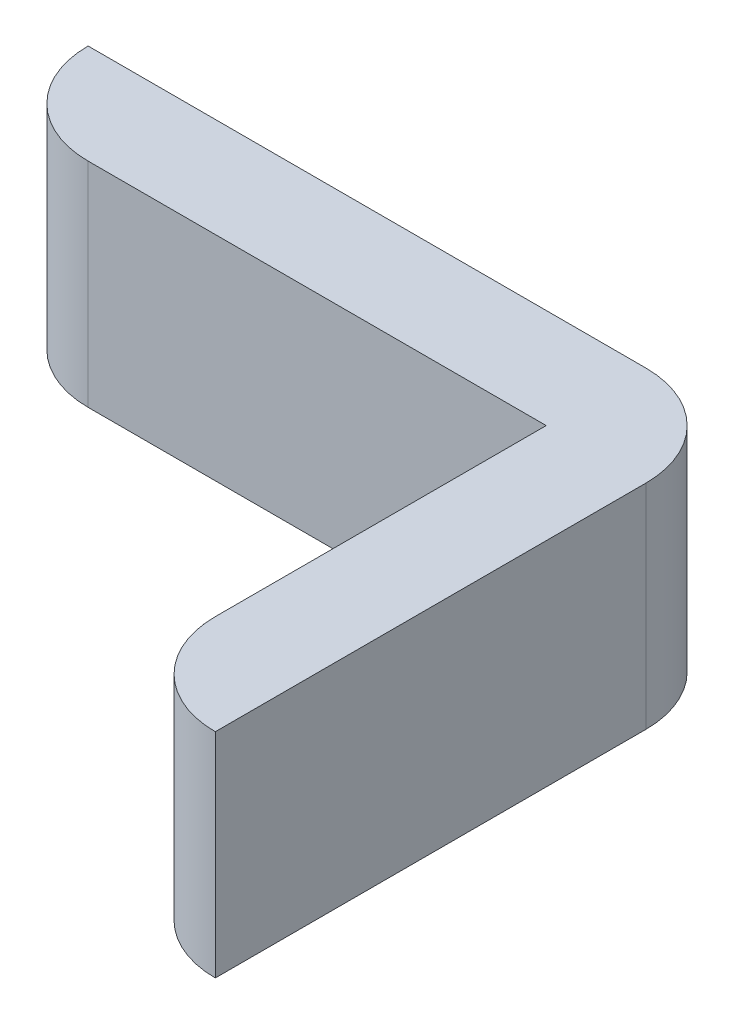
ISO-10303-21;
HEADER;
FILE_DESCRIPTION(('STEP AP214'),'2;1');
FILE_NAME('part.step','',(''),(''),'','','');
FILE_SCHEMA(('AUTOMOTIVE_DESIGN { 1 0 10303 214 1 1 1 1 }'));
ENDSEC;
DATA;
#1=APPLICATION_CONTEXT('core data for automotive mechanical design processes');
#2=APPLICATION_PROTOCOL_DEFINITION('international standard','automotive_design',2000,#1);
#3=PRODUCT_CONTEXT('',#1,'mechanical');
#4=PRODUCT('Part','Part','',(#3));
#5=PRODUCT_RELATED_PRODUCT_CATEGORY('part','',(#4));
#6=PRODUCT_DEFINITION_FORMATION('','',#4);
#7=PRODUCT_DEFINITION_CONTEXT('part definition',#1,'design');
#8=PRODUCT_DEFINITION('design','',#6,#7);
#9=PRODUCT_DEFINITION_SHAPE('','',#8);
#10=(LENGTH_UNIT() NAMED_UNIT(*) SI_UNIT(.MILLI.,.METRE.));
#11=(NAMED_UNIT(*) PLANE_ANGLE_UNIT() SI_UNIT($,.RADIAN.));
#12=(NAMED_UNIT(*) SI_UNIT($,.STERADIAN.) SOLID_ANGLE_UNIT());
#13=UNCERTAINTY_MEASURE_WITH_UNIT(LENGTH_MEASURE(1.E-05),#10,'distance_accuracy_value','');
#14=(GEOMETRIC_REPRESENTATION_CONTEXT(3) GLOBAL_UNCERTAINTY_ASSIGNED_CONTEXT((#13)) GLOBAL_UNIT_ASSIGNED_CONTEXT((#10,
#11,#12)) REPRESENTATION_CONTEXT('',''));
#15=CARTESIAN_POINT('',(0.,0.,0.));
#16=DIRECTION('',(0.,0.,1.));
#17=DIRECTION('',(1.,0.,0.));
#18=AXIS2_PLACEMENT_3D('',#15,#16,#17);
#19=CARTESIAN_POINT('',(-1.0795,0.3675,1.33));
#20=DIRECTION('',(-1.,0.,0.));
#21=DIRECTION('',(0.,0.,1.));
#22=AXIS2_PLACEMENT_3D('',#19,#20,#21);
#23=PLANE('',#22);
#24=DIRECTION('',(0.,0.,-1.));
#25=VECTOR('',#24,1.);
#26=CARTESIAN_POINT('',(-1.0795,0.3675,0.));
#27=LINE('',#26,#25);
#28=CARTESIAN_POINT('',(-1.0795,0.3675,0.25));
#29=VERTEX_POINT('',#28);
#30=CARTESIAN_POINT('',(-1.0795,0.3675,1.33));
#31=VERTEX_POINT('',#30);
#32=EDGE_CURVE('E129',#29,#31,#27,.F.);
#33=ORIENTED_EDGE('',*,*,#32,.F.);
#34=DIRECTION('',(0.,-1.,0.));
#35=VECTOR('',#34,1.);
#36=CARTESIAN_POINT('',(-1.0795,0.3675,0.25));
#37=LINE('',#36,#35);
#38=CARTESIAN_POINT('',(-1.0795,0.9025,0.25));
#39=VERTEX_POINT('',#38);
#40=EDGE_CURVE('E82',#39,#29,#37,.T.);
#41=ORIENTED_EDGE('',*,*,#40,.F.);
#42=DIRECTION('',(0.,0.,-1.));
#43=VECTOR('',#42,1.);
#44=CARTESIAN_POINT('',(-1.0795,0.9025,0.));
#45=LINE('',#44,#43);
#46=CARTESIAN_POINT('',(-1.0795,0.9025,1.33));
#47=VERTEX_POINT('',#46);
#48=EDGE_CURVE('E77',#39,#47,#45,.F.);
#49=ORIENTED_EDGE('',*,*,#48,.T.);
#50=DIRECTION('',(0.,-1.,0.));
#51=VECTOR('',#50,1.);
#52=CARTESIAN_POINT('',(-1.0795,0.3675,1.33));
#53=LINE('',#52,#51);
#54=EDGE_CURVE('E123',#31,#47,#53,.F.);
#55=ORIENTED_EDGE('',*,*,#54,.F.);
#56=EDGE_LOOP('',(#33,#41,#49,#55));
#57=FACE_BOUND('',#56,.T.);
#58=ADVANCED_FACE('F17',(#57),#23,.F.);
#59=CARTESIAN_POINT('',(-1.0795,0.3675,1.08));
#60=DIRECTION('',(0.,-1.,0.));
#61=DIRECTION('',(0.,0.,-1.));
#62=AXIS2_PLACEMENT_3D('',#59,#60,#61);
#63=CYLINDRICAL_SURFACE('',#62,0.25);
#64=CARTESIAN_POINT('',(-1.0795,0.9025,1.08));
#65=DIRECTION('',(0.,-1.,0.));
#66=DIRECTION('',(0.,0.,-1.));
#67=AXIS2_PLACEMENT_3D('',#64,#65,#66);
#68=CIRCLE('',#67,0.25);
#69=CARTESIAN_POINT('',(-1.3295,0.9025,1.08));
#70=VERTEX_POINT('',#69);
#71=EDGE_CURVE('E107',#47,#70,#68,.T.);
#72=ORIENTED_EDGE('',*,*,#71,.T.);
#73=DIRECTION('',(0.,1.,0.));
#74=VECTOR('',#73,1.);
#75=CARTESIAN_POINT('',(-1.3295,0.3675,1.08));
#76=LINE('',#75,#74);
#77=CARTESIAN_POINT('',(-1.3295,0.3675,1.08));
#78=VERTEX_POINT('',#77);
#79=EDGE_CURVE('E118',#70,#78,#76,.F.);
#80=ORIENTED_EDGE('',*,*,#79,.T.);
#81=CARTESIAN_POINT('',(-1.0795,0.3675,1.08));
#82=DIRECTION('',(0.,-1.,0.));
#83=DIRECTION('',(0.,0.,-1.));
#84=AXIS2_PLACEMENT_3D('',#81,#82,#83);
#85=CIRCLE('',#84,0.25);
#86=EDGE_CURVE('E126',#31,#78,#85,.T.);
#87=ORIENTED_EDGE('',*,*,#86,.F.);
#88=ORIENTED_EDGE('',*,*,#54,.T.);
#89=EDGE_LOOP('',(#72,#80,#87,#88));
#90=FACE_BOUND('',#89,.T.);
#91=ADVANCED_FACE('F133',(#90),#63,.T.);
#92=CARTESIAN_POINT('',(-1.3295,0.3675,0.25));
#93=DIRECTION('',(1.,0.,0.));
#94=DIRECTION('',(0.,0.,-1.));
#95=AXIS2_PLACEMENT_3D('',#92,#93,#94);
#96=PLANE('',#95);
#97=ORIENTED_EDGE('',*,*,#79,.F.);
#98=DIRECTION('',(0.,0.,-1.));
#99=VECTOR('',#98,1.);
#100=CARTESIAN_POINT('',(-1.3295,0.9025,0.));
#101=LINE('',#100,#99);
#102=CARTESIAN_POINT('',(-1.3295,0.9025,0.25));
#103=VERTEX_POINT('',#102);
#104=EDGE_CURVE('E102',#70,#103,#101,.T.);
#105=ORIENTED_EDGE('',*,*,#104,.T.);
#106=DIRECTION('',(0.,1.,0.));
#107=VECTOR('',#106,1.);
#108=CARTESIAN_POINT('',(-1.3295,0.3675,0.25));
#109=LINE('',#108,#107);
#110=CARTESIAN_POINT('',(-1.3295,0.3675,0.25));
#111=VERTEX_POINT('',#110);
#112=EDGE_CURVE('E115',#103,#111,#109,.F.);
#113=ORIENTED_EDGE('',*,*,#112,.T.);
#114=DIRECTION('',(0.,0.,-1.));
#115=VECTOR('',#114,1.);
#116=CARTESIAN_POINT('',(-1.3295,0.3675,0.));
#117=LINE('',#116,#115);
#118=EDGE_CURVE('E128',#78,#111,#117,.T.);
#119=ORIENTED_EDGE('',*,*,#118,.F.);
#120=EDGE_LOOP('',(#97,#105,#113,#119));
#121=FACE_BOUND('',#120,.T.);
#122=ADVANCED_FACE('F158',(#121),#96,.F.);
#123=CARTESIAN_POINT('',(-2.4785,0.3675,0.25));
#124=DIRECTION('',(0.,0.,-1.));
#125=DIRECTION('',(-1.,0.,0.));
#126=AXIS2_PLACEMENT_3D('',#123,#124,#125);
#127=PLANE('',#126);
#128=ORIENTED_EDGE('',*,*,#112,.F.);
#129=DIRECTION('',(1.,0.,0.));
#130=VECTOR('',#129,1.);
#131=CARTESIAN_POINT('',(-2.7285,0.9025,0.25));
#132=LINE('',#131,#130);
#133=CARTESIAN_POINT('',(-2.4785,0.9025,0.25));
#134=VERTEX_POINT('',#133);
#135=EDGE_CURVE('E98',#103,#134,#132,.F.);
#136=ORIENTED_EDGE('',*,*,#135,.T.);
#137=DIRECTION('',(0.,-1.,0.));
#138=VECTOR('',#137,1.);
#139=CARTESIAN_POINT('',(-2.4785,0.3675,0.25));
#140=LINE('',#139,#138);
#141=CARTESIAN_POINT('',(-2.4785,0.3675,0.25));
#142=VERTEX_POINT('',#141);
#143=EDGE_CURVE('E101',#142,#134,#140,.F.);
#144=ORIENTED_EDGE('',*,*,#143,.F.);
#145=DIRECTION('',(1.,0.,0.));
#146=VECTOR('',#145,1.);
#147=CARTESIAN_POINT('',(-2.7285,0.3675,0.25));
#148=LINE('',#147,#146);
#149=EDGE_CURVE('E94',#111,#142,#148,.F.);
#150=ORIENTED_EDGE('',*,*,#149,.F.);
#151=EDGE_LOOP('',(#128,#136,#144,#150));
#152=FACE_BOUND('',#151,.T.);
#153=ADVANCED_FACE('F156',(#152),#127,.F.);
#154=CARTESIAN_POINT('',(-1.3295,0.3675,0.25));
#155=DIRECTION('',(0.,-1.,0.));
#156=DIRECTION('',(0.,0.,-1.));
#157=AXIS2_PLACEMENT_3D('',#154,#155,#156);
#158=CYLINDRICAL_SURFACE('',#157,0.25);
#159=CARTESIAN_POINT('',(-1.3295,0.9025,0.25));
#160=DIRECTION('',(0.,-1.,0.));
#161=DIRECTION('',(0.,0.,-1.));
#162=AXIS2_PLACEMENT_3D('',#159,#160,#161);
#163=CIRCLE('',#162,0.25);
#164=CARTESIAN_POINT('',(-1.3295,0.9025,0.));
#165=VERTEX_POINT('',#164);
#166=EDGE_CURVE('E20',#165,#39,#163,.T.);
#167=ORIENTED_EDGE('',*,*,#166,.T.);
#168=ORIENTED_EDGE('',*,*,#40,.T.);
#169=CARTESIAN_POINT('',(-1.3295,0.3675,0.25));
#170=DIRECTION('',(0.,-1.,0.));
#171=DIRECTION('',(0.,0.,-1.));
#172=AXIS2_PLACEMENT_3D('',#169,#170,#171);
#173=CIRCLE('',#172,0.25);
#174=CARTESIAN_POINT('',(-1.3295,0.3675,0.));
#175=VERTEX_POINT('',#174);
#176=EDGE_CURVE('E92',#175,#29,#173,.T.);
#177=ORIENTED_EDGE('',*,*,#176,.F.);
#178=DIRECTION('',(0.,1.,0.));
#179=VECTOR('',#178,1.);
#180=CARTESIAN_POINT('',(-1.3295,0.3675,0.));
#181=LINE('',#180,#179);
#182=EDGE_CURVE('E86',#175,#165,#181,.T.);
#183=ORIENTED_EDGE('',*,*,#182,.T.);
#184=EDGE_LOOP('',(#167,#168,#177,#183));
#185=FACE_BOUND('',#184,.T.);
#186=ADVANCED_FACE('F90',(#185),#158,.T.);
#187=CARTESIAN_POINT('',(-2.7285,0.9025,0.));
#188=DIRECTION('',(0.,-1.,0.));
#189=DIRECTION('',(0.,0.,-1.));
#190=AXIS2_PLACEMENT_3D('',#187,#188,#189);
#191=PLANE('',#190);
#192=ORIENTED_EDGE('',*,*,#135,.F.);
#193=ORIENTED_EDGE('',*,*,#104,.F.);
#194=ORIENTED_EDGE('',*,*,#71,.F.);
#195=ORIENTED_EDGE('',*,*,#48,.F.);
#196=ORIENTED_EDGE('',*,*,#166,.F.);
#197=DIRECTION('',(1.,0.,0.));
#198=VECTOR('',#197,1.);
#199=CARTESIAN_POINT('',(-1.3295,0.9025,0.));
#200=LINE('',#199,#198);
#201=CARTESIAN_POINT('',(-2.7285,0.9025,0.));
#202=VERTEX_POINT('',#201);
#203=EDGE_CURVE('E74',#165,#202,#200,.F.);
#204=ORIENTED_EDGE('',*,*,#203,.T.);
#205=CARTESIAN_POINT('',(-2.4785,0.9025,0.));
#206=DIRECTION('',(0.,-1.,0.));
#207=DIRECTION('',(0.,0.,-1.));
#208=AXIS2_PLACEMENT_3D('',#205,#206,#207);
#209=CIRCLE('',#208,0.25);
#210=EDGE_CURVE('E114',#134,#202,#209,.T.);
#211=ORIENTED_EDGE('',*,*,#210,.F.);
#212=EDGE_LOOP('',(#192,#193,#194,#195,#196,#204,#211));
#213=FACE_BOUND('',#212,.T.);
#214=ADVANCED_FACE('F72',(#213),#191,.F.);
#215=CARTESIAN_POINT('',(-2.4785,0.3675,0.));
#216=DIRECTION('',(0.,-1.,0.));
#217=DIRECTION('',(0.,0.,-1.));
#218=AXIS2_PLACEMENT_3D('',#215,#216,#217);
#219=CYLINDRICAL_SURFACE('',#218,0.25);
#220=ORIENTED_EDGE('',*,*,#210,.T.);
#221=DIRECTION('',(0.,1.,0.));
#222=VECTOR('',#221,1.);
#223=CARTESIAN_POINT('',(-2.7285,0.3675,0.));
#224=LINE('',#223,#222);
#225=CARTESIAN_POINT('',(-2.7285,0.3675,0.));
#226=VERTEX_POINT('',#225);
#227=EDGE_CURVE('E26',#202,#226,#224,.F.);
#228=ORIENTED_EDGE('',*,*,#227,.T.);
#229=CARTESIAN_POINT('',(-2.4785,0.3675,0.));
#230=DIRECTION('',(0.,-1.,0.));
#231=DIRECTION('',(0.,0.,-1.));
#232=AXIS2_PLACEMENT_3D('',#229,#230,#231);
#233=CIRCLE('',#232,0.25);
#234=EDGE_CURVE('E34',#142,#226,#233,.T.);
#235=ORIENTED_EDGE('',*,*,#234,.F.);
#236=ORIENTED_EDGE('',*,*,#143,.T.);
#237=EDGE_LOOP('',(#220,#228,#235,#236));
#238=FACE_BOUND('',#237,.T.);
#239=ADVANCED_FACE('F141',(#238),#219,.T.);
#240=CARTESIAN_POINT('',(-2.7285,0.3675,0.));
#241=DIRECTION('',(0.,-1.,0.));
#242=DIRECTION('',(0.,0.,-1.));
#243=AXIS2_PLACEMENT_3D('',#240,#241,#242);
#244=PLANE('',#243);
#245=ORIENTED_EDGE('',*,*,#149,.T.);
#246=ORIENTED_EDGE('',*,*,#234,.T.);
#247=DIRECTION('',(1.,0.,0.));
#248=VECTOR('',#247,1.);
#249=CARTESIAN_POINT('',(-1.3295,0.3675,0.));
#250=LINE('',#249,#248);
#251=EDGE_CURVE('E11',#226,#175,#250,.T.);
#252=ORIENTED_EDGE('',*,*,#251,.T.);
#253=ORIENTED_EDGE('',*,*,#176,.T.);
#254=ORIENTED_EDGE('',*,*,#32,.T.);
#255=ORIENTED_EDGE('',*,*,#86,.T.);
#256=ORIENTED_EDGE('',*,*,#118,.T.);
#257=EDGE_LOOP('',(#245,#246,#252,#253,#254,#255,#256));
#258=FACE_BOUND('',#257,.T.);
#259=ADVANCED_FACE('F139',(#258),#244,.T.);
#260=CARTESIAN_POINT('',(-1.3295,0.3675,0.));
#261=DIRECTION('',(0.,0.,1.));
#262=DIRECTION('',(1.,0.,0.));
#263=AXIS2_PLACEMENT_3D('',#260,#261,#262);
#264=PLANE('',#263);
#265=ORIENTED_EDGE('',*,*,#227,.F.);
#266=ORIENTED_EDGE('',*,*,#203,.F.);
#267=ORIENTED_EDGE('',*,*,#182,.F.);
#268=ORIENTED_EDGE('',*,*,#251,.F.);
#269=EDGE_LOOP('',(#265,#266,#267,#268));
#270=FACE_BOUND('',#269,.T.);
#271=ADVANCED_FACE('F85',(#270),#264,.F.);
#272=CLOSED_SHELL('',(#58,#91,#122,#153,#186,#214,#239,#259,#271));
#273=MANIFOLD_SOLID_BREP('B1',#272);
#274=ADVANCED_BREP_SHAPE_REPRESENTATION('',(#18,#273),#14);
#275=SHAPE_DEFINITION_REPRESENTATION(#9,#274);
ENDSEC;
END-ISO-10303-21;
